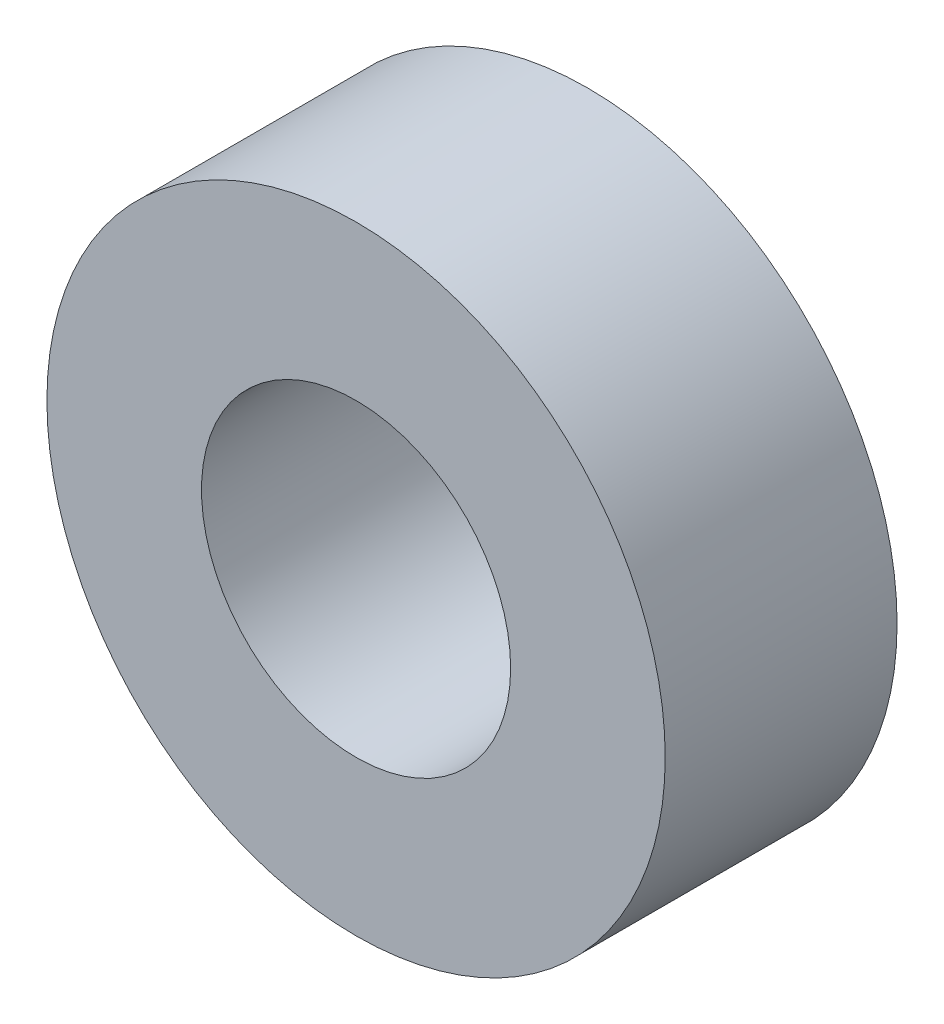
ISO-10303-21;
HEADER;
FILE_DESCRIPTION(('STEP AP214'),'2;1');
FILE_NAME('part.step','',(''),(''),'','','');
FILE_SCHEMA(('AUTOMOTIVE_DESIGN { 1 0 10303 214 1 1 1 1 }'));
ENDSEC;
DATA;
#1=APPLICATION_CONTEXT('core data for automotive mechanical design processes');
#2=APPLICATION_PROTOCOL_DEFINITION('international standard','automotive_design',2000,#1);
#3=PRODUCT_CONTEXT('',#1,'mechanical');
#4=PRODUCT('Part','Part','',(#3));
#5=PRODUCT_RELATED_PRODUCT_CATEGORY('part','',(#4));
#6=PRODUCT_DEFINITION_FORMATION('','',#4);
#7=PRODUCT_DEFINITION_CONTEXT('part definition',#1,'design');
#8=PRODUCT_DEFINITION('design','',#6,#7);
#9=PRODUCT_DEFINITION_SHAPE('','',#8);
#10=(LENGTH_UNIT() NAMED_UNIT(*) SI_UNIT(.MILLI.,.METRE.));
#11=(NAMED_UNIT(*) PLANE_ANGLE_UNIT() SI_UNIT($,.RADIAN.));
#12=(NAMED_UNIT(*) SI_UNIT($,.STERADIAN.) SOLID_ANGLE_UNIT());
#13=UNCERTAINTY_MEASURE_WITH_UNIT(LENGTH_MEASURE(1.E-05),#10,'distance_accuracy_value','');
#14=(GEOMETRIC_REPRESENTATION_CONTEXT(3) GLOBAL_UNCERTAINTY_ASSIGNED_CONTEXT((#13)) GLOBAL_UNIT_ASSIGNED_CONTEXT((#10,
#11,#12)) REPRESENTATION_CONTEXT('',''));
#15=CARTESIAN_POINT('',(0.,0.,0.));
#16=DIRECTION('',(0.,0.,1.));
#17=DIRECTION('',(1.,0.,0.));
#18=AXIS2_PLACEMENT_3D('',#15,#16,#17);
#19=CARTESIAN_POINT('',(0.,0.,3.));
#20=DIRECTION('',(0.,0.,1.));
#21=DIRECTION('',(1.,0.,0.));
#22=AXIS2_PLACEMENT_3D('',#19,#20,#21);
#23=PLANE('',#22);
#24=CARTESIAN_POINT('',(0.,0.,3.));
#25=DIRECTION('',(0.,0.,1.));
#26=DIRECTION('',(1.,0.,0.));
#27=AXIS2_PLACEMENT_3D('',#24,#25,#26);
#28=CIRCLE('',#27,4.);
#29=CARTESIAN_POINT('',(4.,0.,3.));
#30=VERTEX_POINT('',#29);
#31=EDGE_CURVE('E10',#30,#30,#28,.T.);
#32=ORIENTED_EDGE('',*,*,#31,.T.);
#33=EDGE_LOOP('',(#32));
#34=FACE_BOUND('',#33,.T.);
#35=CARTESIAN_POINT('',(0.,0.,3.));
#36=DIRECTION('',(0.,0.,1.));
#37=DIRECTION('',(1.,0.,0.));
#38=AXIS2_PLACEMENT_3D('',#35,#36,#37);
#39=CIRCLE('',#38,2.);
#40=CARTESIAN_POINT('',(2.,0.,3.));
#41=VERTEX_POINT('',#40);
#42=EDGE_CURVE('E46',#41,#41,#39,.T.);
#43=ORIENTED_EDGE('',*,*,#42,.F.);
#44=EDGE_LOOP('',(#43));
#45=FACE_BOUND('',#44,.T.);
#46=ADVANCED_FACE('F35',(#34,#45),#23,.T.);
#47=CARTESIAN_POINT('',(0.,0.,0.));
#48=DIRECTION('',(0.,0.,1.));
#49=DIRECTION('',(1.,0.,0.));
#50=AXIS2_PLACEMENT_3D('',#47,#48,#49);
#51=PLANE('',#50);
#52=CARTESIAN_POINT('',(0.,0.,0.));
#53=DIRECTION('',(0.,0.,1.));
#54=DIRECTION('',(1.,0.,0.));
#55=AXIS2_PLACEMENT_3D('',#52,#53,#54);
#56=CIRCLE('',#55,4.);
#57=CARTESIAN_POINT('',(4.,0.,0.));
#58=VERTEX_POINT('',#57);
#59=EDGE_CURVE('E39',#58,#58,#56,.T.);
#60=ORIENTED_EDGE('',*,*,#59,.F.);
#61=EDGE_LOOP('',(#60));
#62=FACE_BOUND('',#61,.T.);
#63=CARTESIAN_POINT('',(0.,0.,0.));
#64=DIRECTION('',(0.,0.,1.));
#65=DIRECTION('',(1.,0.,0.));
#66=AXIS2_PLACEMENT_3D('',#63,#64,#65);
#67=CIRCLE('',#66,2.);
#68=CARTESIAN_POINT('',(2.,0.,0.));
#69=VERTEX_POINT('',#68);
#70=EDGE_CURVE('E48',#69,#69,#67,.T.);
#71=ORIENTED_EDGE('',*,*,#70,.T.);
#72=EDGE_LOOP('',(#71));
#73=FACE_BOUND('',#72,.T.);
#74=ADVANCED_FACE('F58',(#62,#73),#51,.F.);
#75=CARTESIAN_POINT('',(0.,0.,3.));
#76=DIRECTION('',(0.,0.,-1.));
#77=DIRECTION('',(-1.,0.,0.));
#78=AXIS2_PLACEMENT_3D('',#75,#76,#77);
#79=CYLINDRICAL_SURFACE('',#78,4.);
#80=ORIENTED_EDGE('',*,*,#31,.F.);
#81=EDGE_LOOP('',(#80));
#82=FACE_BOUND('',#81,.T.);
#83=ORIENTED_EDGE('',*,*,#59,.T.);
#84=EDGE_LOOP('',(#83));
#85=FACE_BOUND('',#84,.T.);
#86=ADVANCED_FACE('F37',(#82,#85),#79,.T.);
#87=CARTESIAN_POINT('',(0.,0.,3.));
#88=DIRECTION('',(0.,0.,-1.));
#89=DIRECTION('',(-1.,0.,0.));
#90=AXIS2_PLACEMENT_3D('',#87,#88,#89);
#91=CYLINDRICAL_SURFACE('',#90,2.);
#92=ORIENTED_EDGE('',*,*,#42,.T.);
#93=EDGE_LOOP('',(#92));
#94=FACE_BOUND('',#93,.T.);
#95=ORIENTED_EDGE('',*,*,#70,.F.);
#96=EDGE_LOOP('',(#95));
#97=FACE_BOUND('',#96,.T.);
#98=ADVANCED_FACE('F54',(#94,#97),#91,.F.);
#99=CLOSED_SHELL('',(#46,#74,#86,#98));
#100=MANIFOLD_SOLID_BREP('B2',#99);
#101=ADVANCED_BREP_SHAPE_REPRESENTATION('',(#18,#100),#14);
#102=SHAPE_DEFINITION_REPRESENTATION(#9,#101);
ENDSEC;
END-ISO-10303-21;
